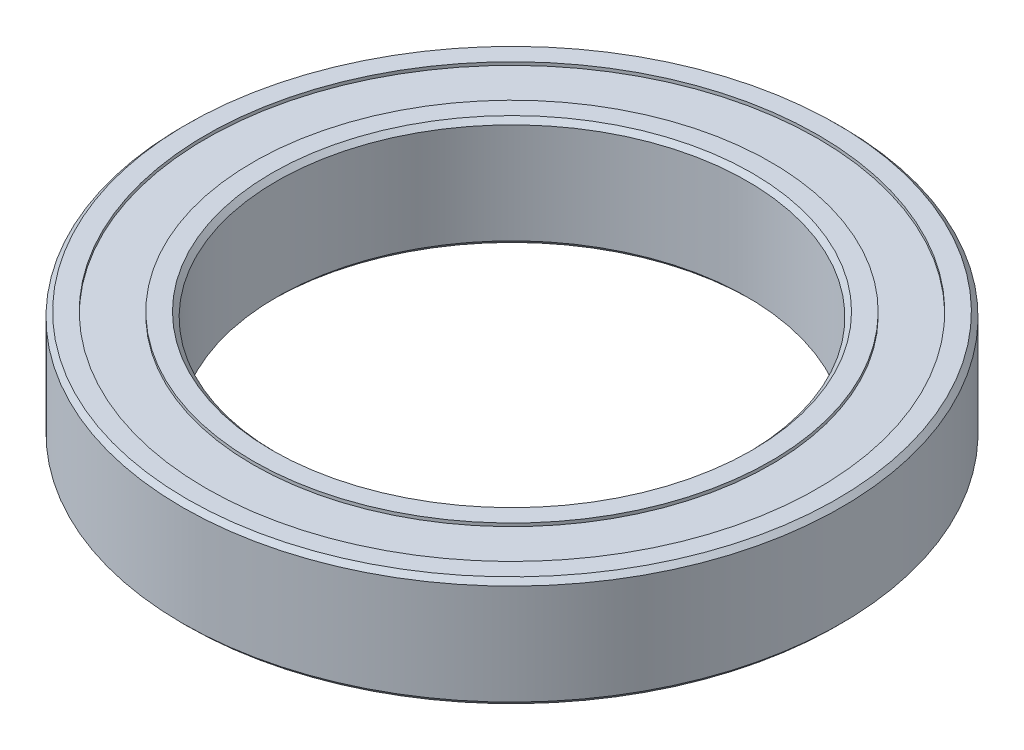
ISO-10303-21;
HEADER;
FILE_DESCRIPTION(('STEP AP214'),'2;1');
FILE_NAME('part.step','',(''),(''),'','','');
FILE_SCHEMA(('AUTOMOTIVE_DESIGN { 1 0 10303 214 1 1 1 1 }'));
ENDSEC;
DATA;
#1=APPLICATION_CONTEXT('core data for automotive mechanical design processes');
#2=APPLICATION_PROTOCOL_DEFINITION('international standard','automotive_design',2000,#1);
#3=PRODUCT_CONTEXT('',#1,'mechanical');
#4=PRODUCT('Part','Part','',(#3));
#5=PRODUCT_RELATED_PRODUCT_CATEGORY('part','',(#4));
#6=PRODUCT_DEFINITION_FORMATION('','',#4);
#7=PRODUCT_DEFINITION_CONTEXT('part definition',#1,'design');
#8=PRODUCT_DEFINITION('design','',#6,#7);
#9=PRODUCT_DEFINITION_SHAPE('','',#8);
#10=(LENGTH_UNIT() NAMED_UNIT(*) SI_UNIT(.MILLI.,.METRE.));
#11=(NAMED_UNIT(*) PLANE_ANGLE_UNIT() SI_UNIT($,.RADIAN.));
#12=(NAMED_UNIT(*) SI_UNIT($,.STERADIAN.) SOLID_ANGLE_UNIT());
#13=UNCERTAINTY_MEASURE_WITH_UNIT(LENGTH_MEASURE(1.E-05),#10,'distance_accuracy_value','');
#14=(GEOMETRIC_REPRESENTATION_CONTEXT(3) GLOBAL_UNCERTAINTY_ASSIGNED_CONTEXT((#13)) GLOBAL_UNIT_ASSIGNED_CONTEXT((#10,
#11,#12)) REPRESENTATION_CONTEXT('',''));
#15=CARTESIAN_POINT('',(0.,0.,0.));
#16=DIRECTION('',(0.,0.,1.));
#17=DIRECTION('',(1.,0.,0.));
#18=AXIS2_PLACEMENT_3D('',#15,#16,#17);
#19=CARTESIAN_POINT('',(0.,0.,0.));
#20=DIRECTION('',(0.,1.,0.));
#21=DIRECTION('',(0.,0.,1.));
#22=AXIS2_PLACEMENT_3D('',#19,#20,#21);
#23=PLANE('',#22);
#24=CARTESIAN_POINT('',(0.,0.,0.));
#25=DIRECTION('',(0.,1.,0.));
#26=DIRECTION('',(0.,0.,1.));
#27=AXIS2_PLACEMENT_3D('',#24,#25,#26);
#28=CIRCLE('',#27,15.3);
#29=CARTESIAN_POINT('',(0.,0.,15.3));
#30=VERTEX_POINT('',#29);
#31=EDGE_CURVE('E58',#30,#30,#28,.T.);
#32=ORIENTED_EDGE('',*,*,#31,.T.);
#33=EDGE_LOOP('',(#32));
#34=FACE_BOUND('',#33,.T.);
#35=CARTESIAN_POINT('',(0.,0.,0.));
#36=DIRECTION('',(0.,-1.,0.));
#37=DIRECTION('',(0.,0.,-1.));
#38=AXIS2_PLACEMENT_3D('',#35,#36,#37);
#39=CIRCLE('',#38,16.5);
#40=CARTESIAN_POINT('',(0.,0.,-16.5));
#41=VERTEX_POINT('',#40);
#42=EDGE_CURVE('E86',#41,#41,#39,.T.);
#43=ORIENTED_EDGE('',*,*,#42,.T.);
#44=EDGE_LOOP('',(#43));
#45=FACE_BOUND('',#44,.T.);
#46=ADVANCED_FACE('F34',(#34,#45),#23,.F.);
#47=CARTESIAN_POINT('',(0.,7.,0.));
#48=DIRECTION('',(0.,1.,0.));
#49=DIRECTION('',(0.,0.,1.));
#50=AXIS2_PLACEMENT_3D('',#47,#48,#49);
#51=PLANE('',#50);
#52=CARTESIAN_POINT('',(0.,7.,0.));
#53=DIRECTION('',(0.,1.,0.));
#54=DIRECTION('',(0.,0.,1.));
#55=AXIS2_PLACEMENT_3D('',#52,#53,#54);
#56=CIRCLE('',#55,15.3);
#57=CARTESIAN_POINT('',(0.,7.,15.3));
#58=VERTEX_POINT('',#57);
#59=EDGE_CURVE('E10',#58,#58,#56,.F.);
#60=ORIENTED_EDGE('',*,*,#59,.T.);
#61=EDGE_LOOP('',(#60));
#62=FACE_BOUND('',#61,.T.);
#63=CARTESIAN_POINT('',(0.,7.,0.));
#64=DIRECTION('',(0.,1.,0.));
#65=DIRECTION('',(0.,0.,1.));
#66=AXIS2_PLACEMENT_3D('',#63,#64,#65);
#67=CIRCLE('',#66,16.5);
#68=CARTESIAN_POINT('',(0.,7.,16.5));
#69=VERTEX_POINT('',#68);
#70=EDGE_CURVE('E74',#69,#69,#67,.T.);
#71=ORIENTED_EDGE('',*,*,#70,.T.);
#72=EDGE_LOOP('',(#71));
#73=FACE_BOUND('',#72,.T.);
#74=ADVANCED_FACE('F137',(#62,#73),#51,.T.);
#75=CARTESIAN_POINT('',(0.,7.,0.));
#76=DIRECTION('',(0.,1.,0.));
#77=DIRECTION('',(0.,0.,1.));
#78=AXIS2_PLACEMENT_3D('',#75,#76,#77);
#79=CIRCLE('',#78,20.7);
#80=CARTESIAN_POINT('',(0.,7.,20.7));
#81=VERTEX_POINT('',#80);
#82=EDGE_CURVE('E50',#81,#81,#79,.T.);
#83=ORIENTED_EDGE('',*,*,#82,.T.);
#84=EDGE_LOOP('',(#83));
#85=FACE_BOUND('',#84,.T.);
#86=CARTESIAN_POINT('',(0.,7.,0.));
#87=DIRECTION('',(0.,1.,0.));
#88=DIRECTION('',(0.,0.,1.));
#89=AXIS2_PLACEMENT_3D('',#86,#87,#88);
#90=CIRCLE('',#89,19.5);
#91=CARTESIAN_POINT('',(0.,7.,19.5));
#92=VERTEX_POINT('',#91);
#93=EDGE_CURVE('E68',#92,#92,#90,.T.);
#94=ORIENTED_EDGE('',*,*,#93,.F.);
#95=EDGE_LOOP('',(#94));
#96=FACE_BOUND('',#95,.T.);
#97=ADVANCED_FACE('F111',(#85,#96),#51,.T.);
#98=CARTESIAN_POINT('',(0.,0.,0.));
#99=DIRECTION('',(0.,-1.,0.));
#100=DIRECTION('',(0.,0.,-1.));
#101=AXIS2_PLACEMENT_3D('',#98,#99,#100);
#102=CIRCLE('',#101,19.5);
#103=CARTESIAN_POINT('',(0.,0.,-19.5));
#104=VERTEX_POINT('',#103);
#105=EDGE_CURVE('E80',#104,#104,#102,.T.);
#106=ORIENTED_EDGE('',*,*,#105,.F.);
#107=EDGE_LOOP('',(#106));
#108=FACE_BOUND('',#107,.T.);
#109=CARTESIAN_POINT('',(0.,0.,0.));
#110=DIRECTION('',(0.,1.,0.));
#111=DIRECTION('',(0.,0.,1.));
#112=AXIS2_PLACEMENT_3D('',#109,#110,#111);
#113=CIRCLE('',#112,20.7);
#114=CARTESIAN_POINT('',(0.,0.,20.7));
#115=VERTEX_POINT('',#114);
#116=EDGE_CURVE('E55',#115,#115,#113,.F.);
#117=ORIENTED_EDGE('',*,*,#116,.T.);
#118=EDGE_LOOP('',(#117));
#119=FACE_BOUND('',#118,.T.);
#120=ADVANCED_FACE('F107',(#108,#119),#23,.F.);
#121=CARTESIAN_POINT('',(0.,7.,0.));
#122=DIRECTION('',(0.,-1.,0.));
#123=DIRECTION('',(0.,0.,-1.));
#124=AXIS2_PLACEMENT_3D('',#121,#122,#123);
#125=CYLINDRICAL_SURFACE('',#124,21.);
#126=CARTESIAN_POINT('',(0.,0.300000000000002,0.));
#127=DIRECTION('',(0.,1.,0.));
#128=DIRECTION('',(0.,0.,1.));
#129=AXIS2_PLACEMENT_3D('',#126,#127,#128);
#130=CIRCLE('',#129,21.);
#131=CARTESIAN_POINT('',(0.,0.300000000000002,21.));
#132=VERTEX_POINT('',#131);
#133=EDGE_CURVE('E61',#132,#132,#130,.T.);
#134=ORIENTED_EDGE('',*,*,#133,.T.);
#135=EDGE_LOOP('',(#134));
#136=FACE_BOUND('',#135,.T.);
#137=CARTESIAN_POINT('',(0.,6.70000000000001,0.));
#138=DIRECTION('',(0.,1.,0.));
#139=DIRECTION('',(0.,0.,1.));
#140=AXIS2_PLACEMENT_3D('',#137,#138,#139);
#141=CIRCLE('',#140,21.);
#142=CARTESIAN_POINT('',(0.,6.70000000000001,21.));
#143=VERTEX_POINT('',#142);
#144=EDGE_CURVE('E64',#143,#143,#141,.F.);
#145=ORIENTED_EDGE('',*,*,#144,.T.);
#146=EDGE_LOOP('',(#145));
#147=FACE_BOUND('',#146,.T.);
#148=ADVANCED_FACE('F110',(#136,#147),#125,.T.);
#149=CARTESIAN_POINT('',(0.,7.,0.));
#150=DIRECTION('',(0.,-1.,0.));
#151=DIRECTION('',(0.,0.,-1.));
#152=AXIS2_PLACEMENT_3D('',#149,#150,#151);
#153=CYLINDRICAL_SURFACE('',#152,15.);
#154=CARTESIAN_POINT('',(0.,0.300000000000003,0.));
#155=DIRECTION('',(0.,1.,0.));
#156=DIRECTION('',(0.,0.,1.));
#157=AXIS2_PLACEMENT_3D('',#154,#155,#156);
#158=CIRCLE('',#157,15.);
#159=CARTESIAN_POINT('',(0.,0.300000000000003,15.));
#160=VERTEX_POINT('',#159);
#161=EDGE_CURVE('E42',#160,#160,#158,.F.);
#162=ORIENTED_EDGE('',*,*,#161,.T.);
#163=EDGE_LOOP('',(#162));
#164=FACE_BOUND('',#163,.T.);
#165=CARTESIAN_POINT('',(0.,6.70000000000002,0.));
#166=DIRECTION('',(0.,1.,0.));
#167=DIRECTION('',(0.,0.,1.));
#168=AXIS2_PLACEMENT_3D('',#165,#166,#167);
#169=CIRCLE('',#168,15.);
#170=CARTESIAN_POINT('',(0.,6.70000000000002,15.));
#171=VERTEX_POINT('',#170);
#172=EDGE_CURVE('E46',#171,#171,#169,.T.);
#173=ORIENTED_EDGE('',*,*,#172,.T.);
#174=EDGE_LOOP('',(#173));
#175=FACE_BOUND('',#174,.T.);
#176=ADVANCED_FACE('F125',(#164,#175),#153,.F.);
#177=CARTESIAN_POINT('',(0.,6.8,0.));
#178=DIRECTION('',(0.,1.,0.));
#179=DIRECTION('',(0.,0.,1.));
#180=AXIS2_PLACEMENT_3D('',#177,#178,#179);
#181=CYLINDRICAL_SURFACE('',#180,19.5);
#182=CARTESIAN_POINT('',(0.,6.8,0.));
#183=DIRECTION('',(0.,1.,0.));
#184=DIRECTION('',(0.,0.,1.));
#185=AXIS2_PLACEMENT_3D('',#182,#183,#184);
#186=CIRCLE('',#185,19.5);
#187=CARTESIAN_POINT('',(0.,6.8,19.5));
#188=VERTEX_POINT('',#187);
#189=EDGE_CURVE('E67',#188,#188,#186,.T.);
#190=ORIENTED_EDGE('',*,*,#189,.F.);
#191=EDGE_LOOP('',(#190));
#192=FACE_BOUND('',#191,.T.);
#193=ORIENTED_EDGE('',*,*,#93,.T.);
#194=EDGE_LOOP('',(#193));
#195=FACE_BOUND('',#194,.T.);
#196=ADVANCED_FACE('F141',(#192,#195),#181,.F.);
#197=CARTESIAN_POINT('',(0.,6.8,0.));
#198=DIRECTION('',(0.,1.,0.));
#199=DIRECTION('',(0.,0.,1.));
#200=AXIS2_PLACEMENT_3D('',#197,#198,#199);
#201=PLANE('',#200);
#202=CARTESIAN_POINT('',(0.,6.8,0.));
#203=DIRECTION('',(0.,1.,0.));
#204=DIRECTION('',(0.,0.,1.));
#205=AXIS2_PLACEMENT_3D('',#202,#203,#204);
#206=CIRCLE('',#205,16.5);
#207=CARTESIAN_POINT('',(0.,6.8,16.5));
#208=VERTEX_POINT('',#207);
#209=EDGE_CURVE('E71',#208,#208,#206,.T.);
#210=ORIENTED_EDGE('',*,*,#209,.F.);
#211=EDGE_LOOP('',(#210));
#212=FACE_BOUND('',#211,.T.);
#213=ORIENTED_EDGE('',*,*,#189,.T.);
#214=EDGE_LOOP('',(#213));
#215=FACE_BOUND('',#214,.T.);
#216=ADVANCED_FACE('F143',(#212,#215),#201,.T.);
#217=CARTESIAN_POINT('',(0.,6.8,0.));
#218=DIRECTION('',(0.,1.,0.));
#219=DIRECTION('',(0.,0.,1.));
#220=AXIS2_PLACEMENT_3D('',#217,#218,#219);
#221=CYLINDRICAL_SURFACE('',#220,16.5);
#222=ORIENTED_EDGE('',*,*,#209,.T.);
#223=EDGE_LOOP('',(#222));
#224=FACE_BOUND('',#223,.T.);
#225=ORIENTED_EDGE('',*,*,#70,.F.);
#226=EDGE_LOOP('',(#225));
#227=FACE_BOUND('',#226,.T.);
#228=ADVANCED_FACE('F119',(#224,#227),#221,.T.);
#229=CARTESIAN_POINT('',(0.,0.300000000000002,0.));
#230=DIRECTION('',(0.,1.,0.));
#231=DIRECTION('',(0.,0.,1.));
#232=AXIS2_PLACEMENT_3D('',#229,#230,#231);
#233=CONICAL_SURFACE('',#232,21.,0.785398163397454);
#234=ORIENTED_EDGE('',*,*,#116,.F.);
#235=EDGE_LOOP('',(#234));
#236=FACE_BOUND('',#235,.T.);
#237=ORIENTED_EDGE('',*,*,#133,.F.);
#238=EDGE_LOOP('',(#237));
#239=FACE_BOUND('',#238,.T.);
#240=ADVANCED_FACE('F115',(#236,#239),#233,.T.);
#241=CARTESIAN_POINT('',(0.,7.,0.));
#242=DIRECTION('',(0.,-1.,0.));
#243=DIRECTION('',(0.,0.,-1.));
#244=AXIS2_PLACEMENT_3D('',#241,#242,#243);
#245=CONICAL_SURFACE('',#244,20.7,0.785398163397466);
#246=ORIENTED_EDGE('',*,*,#144,.F.);
#247=EDGE_LOOP('',(#246));
#248=FACE_BOUND('',#247,.T.);
#249=ORIENTED_EDGE('',*,*,#82,.F.);
#250=EDGE_LOOP('',(#249));
#251=FACE_BOUND('',#250,.T.);
#252=ADVANCED_FACE('F118',(#248,#251),#245,.T.);
#253=CARTESIAN_POINT('',(0.,0.,0.));
#254=DIRECTION('',(0.,-1.,0.));
#255=DIRECTION('',(0.,0.,-1.));
#256=AXIS2_PLACEMENT_3D('',#253,#254,#255);
#257=CONICAL_SURFACE('',#256,15.3,0.785398163397445);
#258=ORIENTED_EDGE('',*,*,#161,.F.);
#259=EDGE_LOOP('',(#258));
#260=FACE_BOUND('',#259,.T.);
#261=ORIENTED_EDGE('',*,*,#31,.F.);
#262=EDGE_LOOP('',(#261));
#263=FACE_BOUND('',#262,.T.);
#264=ADVANCED_FACE('F131',(#260,#263),#257,.F.);
#265=CARTESIAN_POINT('',(0.,6.70000000000002,0.));
#266=DIRECTION('',(0.,1.,0.));
#267=DIRECTION('',(0.,0.,1.));
#268=AXIS2_PLACEMENT_3D('',#265,#266,#267);
#269=CONICAL_SURFACE('',#268,15.,0.785398163397463);
#270=ORIENTED_EDGE('',*,*,#59,.F.);
#271=EDGE_LOOP('',(#270));
#272=FACE_BOUND('',#271,.T.);
#273=ORIENTED_EDGE('',*,*,#172,.F.);
#274=EDGE_LOOP('',(#273));
#275=FACE_BOUND('',#274,.T.);
#276=ADVANCED_FACE('F37',(#272,#275),#269,.F.);
#277=CARTESIAN_POINT('',(0.,0.2,0.));
#278=DIRECTION('',(0.,-1.,0.));
#279=DIRECTION('',(0.,0.,-1.));
#280=AXIS2_PLACEMENT_3D('',#277,#278,#279);
#281=CYLINDRICAL_SURFACE('',#280,19.5);
#282=CARTESIAN_POINT('',(0.,0.2,0.));
#283=DIRECTION('',(0.,-1.,0.));
#284=DIRECTION('',(0.,0.,-1.));
#285=AXIS2_PLACEMENT_3D('',#282,#283,#284);
#286=CIRCLE('',#285,19.5);
#287=CARTESIAN_POINT('',(0.,0.2,-19.5));
#288=VERTEX_POINT('',#287);
#289=EDGE_CURVE('E77',#288,#288,#286,.T.);
#290=ORIENTED_EDGE('',*,*,#289,.F.);
#291=EDGE_LOOP('',(#290));
#292=FACE_BOUND('',#291,.T.);
#293=ORIENTED_EDGE('',*,*,#105,.T.);
#294=EDGE_LOOP('',(#293));
#295=FACE_BOUND('',#294,.T.);
#296=ADVANCED_FACE('F98',(#292,#295),#281,.F.);
#297=CARTESIAN_POINT('',(0.,0.2,0.));
#298=DIRECTION('',(0.,-1.,0.));
#299=DIRECTION('',(0.,0.,-1.));
#300=AXIS2_PLACEMENT_3D('',#297,#298,#299);
#301=PLANE('',#300);
#302=CARTESIAN_POINT('',(0.,0.2,0.));
#303=DIRECTION('',(0.,-1.,0.));
#304=DIRECTION('',(0.,0.,-1.));
#305=AXIS2_PLACEMENT_3D('',#302,#303,#304);
#306=CIRCLE('',#305,16.5);
#307=CARTESIAN_POINT('',(0.,0.2,-16.5));
#308=VERTEX_POINT('',#307);
#309=EDGE_CURVE('E83',#308,#308,#306,.T.);
#310=ORIENTED_EDGE('',*,*,#309,.F.);
#311=EDGE_LOOP('',(#310));
#312=FACE_BOUND('',#311,.T.);
#313=ORIENTED_EDGE('',*,*,#289,.T.);
#314=EDGE_LOOP('',(#313));
#315=FACE_BOUND('',#314,.T.);
#316=ADVANCED_FACE('F95',(#312,#315),#301,.T.);
#317=CARTESIAN_POINT('',(0.,0.2,0.));
#318=DIRECTION('',(0.,-1.,0.));
#319=DIRECTION('',(0.,0.,-1.));
#320=AXIS2_PLACEMENT_3D('',#317,#318,#319);
#321=CYLINDRICAL_SURFACE('',#320,16.5);
#322=ORIENTED_EDGE('',*,*,#309,.T.);
#323=EDGE_LOOP('',(#322));
#324=FACE_BOUND('',#323,.T.);
#325=ORIENTED_EDGE('',*,*,#42,.F.);
#326=EDGE_LOOP('',(#325));
#327=FACE_BOUND('',#326,.T.);
#328=ADVANCED_FACE('F92',(#324,#327),#321,.T.);
#329=CLOSED_SHELL('',(#46,#74,#97,#120,#148,#176,#196,#216,#228,#240,#252,#264,#276,#296,#316,#328));
#330=MANIFOLD_SOLID_BREP('B2',#329);
#331=ADVANCED_BREP_SHAPE_REPRESENTATION('',(#18,#330),#14);
#332=SHAPE_DEFINITION_REPRESENTATION(#9,#331);
ENDSEC;
END-ISO-10303-21;
